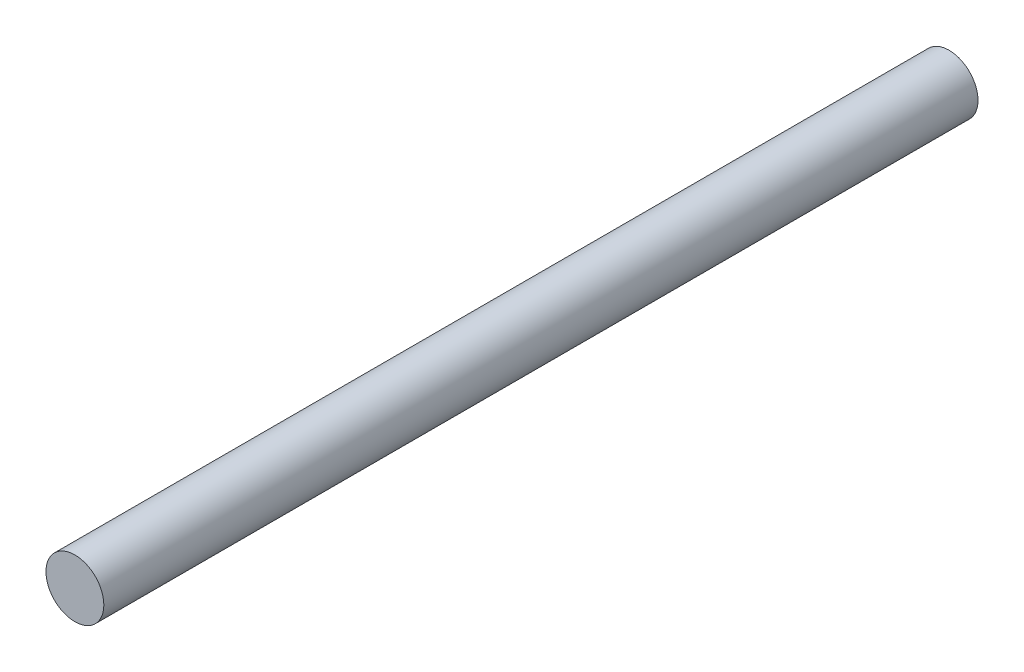
ISO-10303-21;
HEADER;
FILE_DESCRIPTION(('STEP AP214'),'2;1');
FILE_NAME('part.step','',(''),(''),'','','');
FILE_SCHEMA(('AUTOMOTIVE_DESIGN { 1 0 10303 214 1 1 1 1 }'));
ENDSEC;
DATA;
#1=APPLICATION_CONTEXT('core data for automotive mechanical design processes');
#2=APPLICATION_PROTOCOL_DEFINITION('international standard','automotive_design',2000,#1);
#3=PRODUCT_CONTEXT('',#1,'mechanical');
#4=PRODUCT('Part','Part','',(#3));
#5=PRODUCT_RELATED_PRODUCT_CATEGORY('part','',(#4));
#6=PRODUCT_DEFINITION_FORMATION('','',#4);
#7=PRODUCT_DEFINITION_CONTEXT('part definition',#1,'design');
#8=PRODUCT_DEFINITION('design','',#6,#7);
#9=PRODUCT_DEFINITION_SHAPE('','',#8);
#10=(LENGTH_UNIT() NAMED_UNIT(*) SI_UNIT(.MILLI.,.METRE.));
#11=(NAMED_UNIT(*) PLANE_ANGLE_UNIT() SI_UNIT($,.RADIAN.));
#12=(NAMED_UNIT(*) SI_UNIT($,.STERADIAN.) SOLID_ANGLE_UNIT());
#13=UNCERTAINTY_MEASURE_WITH_UNIT(LENGTH_MEASURE(1.E-05),#10,'distance_accuracy_value','');
#14=(GEOMETRIC_REPRESENTATION_CONTEXT(3) GLOBAL_UNCERTAINTY_ASSIGNED_CONTEXT((#13)) GLOBAL_UNIT_ASSIGNED_CONTEXT((#10,
#11,#12)) REPRESENTATION_CONTEXT('',''));
#15=CARTESIAN_POINT('',(0.,0.,0.));
#16=DIRECTION('',(0.,0.,1.));
#17=DIRECTION('',(1.,0.,0.));
#18=AXIS2_PLACEMENT_3D('',#15,#16,#17);
#19=CARTESIAN_POINT('',(0.,0.,365.));
#20=DIRECTION('',(0.,0.,-1.));
#21=DIRECTION('',(-1.,0.,0.));
#22=AXIS2_PLACEMENT_3D('',#19,#20,#21);
#23=CYLINDRICAL_SURFACE('',#22,12.5);
#24=CARTESIAN_POINT('',(0.,0.,0.));
#25=DIRECTION('',(0.,0.,1.));
#26=DIRECTION('',(1.,0.,0.));
#27=AXIS2_PLACEMENT_3D('',#24,#25,#26);
#28=CIRCLE('',#27,12.5);
#29=CARTESIAN_POINT('',(12.5,0.,0.));
#30=VERTEX_POINT('',#29);
#31=EDGE_CURVE('E10',#30,#30,#28,.T.);
#32=ORIENTED_EDGE('',*,*,#31,.T.);
#33=EDGE_LOOP('',(#32));
#34=FACE_BOUND('',#33,.T.);
#35=CARTESIAN_POINT('',(0.,0.,377.5));
#36=DIRECTION('',(0.,0.,1.));
#37=DIRECTION('',(1.,0.,0.));
#38=AXIS2_PLACEMENT_3D('',#35,#36,#37);
#39=CIRCLE('',#38,12.5);
#40=CARTESIAN_POINT('',(12.5,0.,377.5));
#41=VERTEX_POINT('',#40);
#42=EDGE_CURVE('E44',#41,#41,#39,.T.);
#43=ORIENTED_EDGE('',*,*,#42,.F.);
#44=EDGE_LOOP('',(#43));
#45=FACE_BOUND('',#44,.T.);
#46=ADVANCED_FACE('F37',(#34,#45),#23,.T.);
#47=CARTESIAN_POINT('',(0.,0.,0.));
#48=DIRECTION('',(0.,0.,1.));
#49=DIRECTION('',(1.,0.,0.));
#50=AXIS2_PLACEMENT_3D('',#47,#48,#49);
#51=PLANE('',#50);
#52=ORIENTED_EDGE('',*,*,#31,.F.);
#53=EDGE_LOOP('',(#52));
#54=FACE_BOUND('',#53,.T.);
#55=ADVANCED_FACE('F54',(#54),#51,.F.);
#56=CARTESIAN_POINT('',(0.,0.,377.5));
#57=DIRECTION('',(0.,0.,1.));
#58=DIRECTION('',(1.,0.,0.));
#59=AXIS2_PLACEMENT_3D('',#56,#57,#58);
#60=PLANE('',#59);
#61=ORIENTED_EDGE('',*,*,#42,.T.);
#62=EDGE_LOOP('',(#61));
#63=FACE_BOUND('',#62,.T.);
#64=ADVANCED_FACE('F51',(#63),#60,.T.);
#65=CLOSED_SHELL('',(#46,#55,#64));
#66=MANIFOLD_SOLID_BREP('B2',#65);
#67=ADVANCED_BREP_SHAPE_REPRESENTATION('',(#18,#66),#14);
#68=SHAPE_DEFINITION_REPRESENTATION(#9,#67);
ENDSEC;
END-ISO-10303-21;
